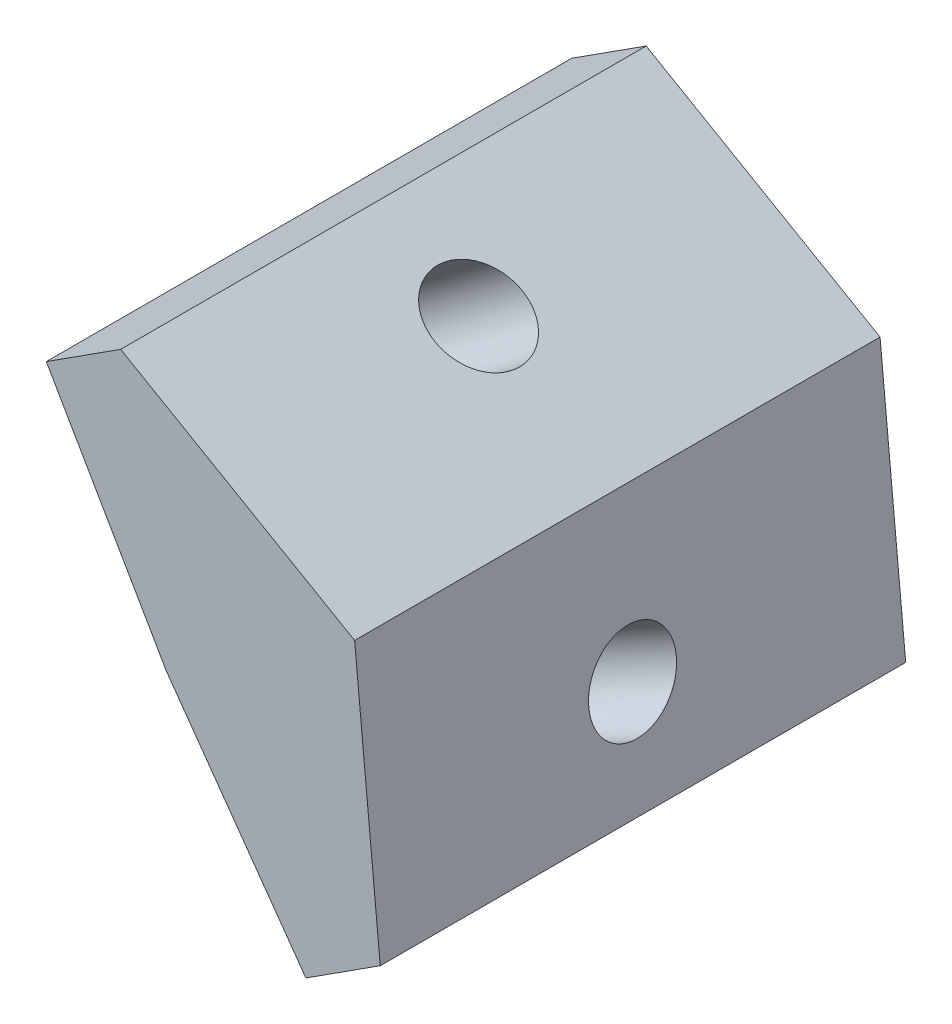
ISO-10303-21;
HEADER;
FILE_DESCRIPTION(('STEP AP214'),'2;1');
FILE_NAME('part.step','',(''),(''),'','','');
FILE_SCHEMA(('AUTOMOTIVE_DESIGN { 1 0 10303 214 1 1 1 1 }'));
ENDSEC;
DATA;
#1=APPLICATION_CONTEXT('core data for automotive mechanical design processes');
#2=APPLICATION_PROTOCOL_DEFINITION('international standard','automotive_design',2000,#1);
#3=PRODUCT_CONTEXT('',#1,'mechanical');
#4=PRODUCT('Part','Part','',(#3));
#5=PRODUCT_RELATED_PRODUCT_CATEGORY('part','',(#4));
#6=PRODUCT_DEFINITION_FORMATION('','',#4);
#7=PRODUCT_DEFINITION_CONTEXT('part definition',#1,'design');
#8=PRODUCT_DEFINITION('design','',#6,#7);
#9=PRODUCT_DEFINITION_SHAPE('','',#8);
#10=(LENGTH_UNIT() NAMED_UNIT(*) SI_UNIT(.MILLI.,.METRE.));
#11=(NAMED_UNIT(*) PLANE_ANGLE_UNIT() SI_UNIT($,.RADIAN.));
#12=(NAMED_UNIT(*) SI_UNIT($,.STERADIAN.) SOLID_ANGLE_UNIT());
#13=UNCERTAINTY_MEASURE_WITH_UNIT(LENGTH_MEASURE(1.E-05),#10,'distance_accuracy_value','');
#14=(GEOMETRIC_REPRESENTATION_CONTEXT(3) GLOBAL_UNCERTAINTY_ASSIGNED_CONTEXT((#13)) GLOBAL_UNIT_ASSIGNED_CONTEXT((#10,
#11,#12)) REPRESENTATION_CONTEXT('',''));
#15=CARTESIAN_POINT('',(0.,0.,0.));
#16=DIRECTION('',(0.,0.,1.));
#17=DIRECTION('',(1.,0.,0.));
#18=AXIS2_PLACEMENT_3D('',#15,#16,#17);
#19=CARTESIAN_POINT('',(2.14350896906507,-9.8273254068607,7.5));
#20=DIRECTION('',(0.866025403784439,0.5,0.));
#21=DIRECTION('',(-0.5,0.866025403784439,0.));
#22=AXIS2_PLACEMENT_3D('',#19,#20,#21);
#23=PLANE('',#22);
#24=DIRECTION('',(0.5,-0.866025403784439,0.));
#25=VECTOR('',#24,1.);
#26=CARTESIAN_POINT('',(2.14350896906507,-9.8273254068607,-7.5));
#27=LINE('',#26,#25);
#28=CARTESIAN_POINT('',(-1.28768671203867,-3.88432015647812,-7.5));
#29=VERTEX_POINT('',#28);
#30=CARTESIAN_POINT('',(2.14350896906507,-9.8273254068607,-7.5));
#31=VERTEX_POINT('',#30);
#32=EDGE_CURVE('E143',#29,#31,#27,.T.);
#33=ORIENTED_EDGE('',*,*,#32,.T.);
#34=DIRECTION('',(0.,0.,-1.));
#35=VECTOR('',#34,1.);
#36=CARTESIAN_POINT('',(2.14350896906507,-9.8273254068607,7.5));
#37=LINE('',#36,#35);
#38=CARTESIAN_POINT('',(2.14350896906507,-9.8273254068607,7.5));
#39=VERTEX_POINT('',#38);
#40=EDGE_CURVE('E140',#39,#31,#37,.T.);
#41=ORIENTED_EDGE('',*,*,#40,.F.);
#42=DIRECTION('',(0.5,-0.866025403784439,0.));
#43=VECTOR('',#42,1.);
#44=CARTESIAN_POINT('',(2.14350896906507,-9.8273254068607,7.5));
#45=LINE('',#44,#43);
#46=CARTESIAN_POINT('',(-1.28768671203867,-3.88432015647812,7.5));
#47=VERTEX_POINT('',#46);
#48=EDGE_CURVE('E85',#47,#39,#45,.T.);
#49=ORIENTED_EDGE('',*,*,#48,.F.);
#50=DIRECTION('',(0.,0.,-1.));
#51=VECTOR('',#50,1.);
#52=CARTESIAN_POINT('',(-1.28768671203867,-3.88432015647812,7.5));
#53=LINE('',#52,#51);
#54=EDGE_CURVE('E52',#47,#29,#53,.T.);
#55=ORIENTED_EDGE('',*,*,#54,.T.);
#56=EDGE_LOOP('',(#33,#41,#49,#55));
#57=FACE_BOUND('',#56,.T.);
#58=CARTESIAN_POINT('',(0.883104032008484,-7.64424001776803,0.));
#59=CARTESIAN_POINT('',(0.883102340796539,-7.64423708850301,0.0692360491478806));
#60=CARTESIAN_POINT('',(0.880217251156279,-7.6392399666617,0.138544782789748));
#61=CARTESIAN_POINT('',(0.868752455011231,-7.61938235724007,0.275212517791071));
#62=CARTESIAN_POINT('',(0.860172748501076,-7.60452186965044,0.342571519148689));
#63=CARTESIAN_POINT('',(0.837557341279015,-7.56535083530797,0.473531081509149));
#64=CARTESIAN_POINT('',(0.823521641926395,-7.54104029090948,0.53713164344835));
#65=CARTESIAN_POINT('',(0.790380846593859,-7.48363874959029,0.658806955690412));
#66=CARTESIAN_POINT('',(0.771275752709145,-7.45054775629858,0.7168817082771));
#67=CARTESIAN_POINT('',(0.728523260341341,-7.37649826736734,0.825907151696571));
#68=CARTESIAN_POINT('',(0.704875864028337,-7.3355397754865,0.876857845932855));
#69=CARTESIAN_POINT('',(0.653690960560685,-7.24688492210003,0.970228943636717));
#70=CARTESIAN_POINT('',(0.626153455311613,-7.19918856389494,1.01264935128285));
#71=CARTESIAN_POINT('',(0.567947868615407,-7.09837353045275,1.0877901267426));
#72=CARTESIAN_POINT('',(0.537279788571654,-7.04525485764636,1.12051049890455));
#73=CARTESIAN_POINT('',(0.47365891688207,-6.93506027545818,1.17534867469813));
#74=CARTESIAN_POINT('',(0.440706126053246,-6.87798436749149,1.19746648212118));
#75=CARTESIAN_POINT('',(0.373424713651803,-6.76144954280719,1.23048951778944));
#76=CARTESIAN_POINT('',(0.339096092392505,-6.70199062663229,1.24139474858811));
#77=CARTESIAN_POINT('',(0.27000984431079,-6.58232973485045,1.25169185177927));
#78=CARTESIAN_POINT('',(0.235252217519653,-6.5221277592977,1.25108372501126));
#79=CARTESIAN_POINT('',(0.166266618585461,-6.40264119695311,1.23837088949851));
#80=CARTESIAN_POINT('',(0.132038646442173,-6.34335661016087,1.22626618075885));
#81=CARTESIAN_POINT('',(0.0650564104898266,-6.22733997428683,1.19089404721105));
#82=CARTESIAN_POINT('',(0.03230214667851,-6.17060792520112,1.16762662242002));
#83=CARTESIAN_POINT('',(-0.0308292666829017,-6.06126110970552,1.11057080716508));
#84=CARTESIAN_POINT('',(-0.0612064162388335,-6.00864634328553,1.07678241672701));
#85=CARTESIAN_POINT('',(-0.11874576040662,-5.90898527575274,0.999616602972544));
#86=CARTESIAN_POINT('',(-0.145907955028472,-5.86193897462262,0.956239179685969));
#87=CARTESIAN_POINT('',(-0.196268222635298,-5.77471243244483,0.861091710242495));
#88=CARTESIAN_POINT('',(-0.21946629563384,-5.73453219137366,0.809321664114325));
#89=CARTESIAN_POINT('',(-0.261258489953188,-5.66214598745276,0.69881683635393));
#90=CARTESIAN_POINT('',(-0.27985261128947,-5.62994002457622,0.640082054745118));
#91=CARTESIAN_POINT('',(-0.311924055638079,-5.5743906534923,0.51726773696082));
#92=CARTESIAN_POINT('',(-0.325401378665407,-5.55104724525895,0.453188200801003));
#93=CARTESIAN_POINT('',(-0.346867507393485,-5.51386681966011,0.32145176709954));
#94=CARTESIAN_POINT('',(-0.354856313106203,-5.5000298022739,0.253794869565694));
#95=CARTESIAN_POINT('',(-0.365125067658483,-5.48224379765889,0.116769772117528));
#96=CARTESIAN_POINT('',(-0.367405016504841,-5.47829481041833,0.0474015722052451));
#97=CARTESIAN_POINT('',(-0.366193174015858,-5.48039378318001,-0.0911328723644529));
#98=CARTESIAN_POINT('',(-0.362701382680923,-5.48644174318156,-0.160299117021883));
#99=CARTESIAN_POINT('',(-0.350042367017631,-5.5083678014842,-0.29652196348423));
#100=CARTESIAN_POINT('',(-0.34087514268327,-5.52424589979569,-0.363578565286915));
#101=CARTESIAN_POINT('',(-0.317118102643942,-5.56539430018125,-0.493732623558334));
#102=CARTESIAN_POINT('',(-0.302528286927751,-5.59066460227476,-0.556830080018871));
#103=CARTESIAN_POINT('',(-0.268328467004248,-5.64990042799197,-0.677325540871189));
#104=CARTESIAN_POINT('',(-0.248718462782602,-5.68386595164051,-0.734723545246694));
#105=CARTESIAN_POINT('',(-0.205019131894172,-5.75955541299604,-0.842236990429847));
#106=CARTESIAN_POINT('',(-0.18092980521248,-5.80127935072885,-0.892352431213258));
#107=CARTESIAN_POINT('',(-0.128936241544613,-5.89133484466816,-0.983918497506408));
#108=CARTESIAN_POINT('',(-0.10103200454533,-5.93966640089736,-1.02536912298638));
#109=CARTESIAN_POINT('',(-0.0421782536827786,-6.04160408760731,-1.09846229197649));
#110=CARTESIAN_POINT('',(-0.0112287398098648,-6.09521021810476,-1.13010483545557));
#111=CARTESIAN_POINT('',(0.052861937281228,-6.20621852711802,-1.18270909288413));
#112=CARTESIAN_POINT('',(0.0860031005049996,-6.26362070564352,-1.20367080680635));
#113=CARTESIAN_POINT('',(0.153562998960528,-6.38063788232269,-1.23433524955404));
#114=CARTESIAN_POINT('',(0.187981734194402,-6.44025288048003,-1.24403797836085));
#115=CARTESIAN_POINT('',(0.257147461311182,-6.56005143398873,-1.2519168349498));
#116=CARTESIAN_POINT('',(0.29189445319428,-6.62023498934042,-1.25009296272525));
#117=CARTESIAN_POINT('',(0.360758324433378,-6.73951071313242,-1.234968921888));
#118=CARTESIAN_POINT('',(0.394875203789732,-6.79860288157334,-1.22166875328174));
#119=CARTESIAN_POINT('',(0.461537859932307,-6.91406598897979,-1.18395896049844));
#120=CARTESIAN_POINT('',(0.494083636721105,-6.97043692794979,-1.15954933633961));
#121=CARTESIAN_POINT('',(0.5567064341663,-7.07890279483694,-1.10029387881346));
#122=CARTESIAN_POINT('',(0.586783454828964,-7.13099772276495,-1.06544804547263));
#123=CARTESIAN_POINT('',(0.643639170382284,-7.22947471080399,-0.986281295689709));
#124=CARTESIAN_POINT('',(0.67041786528336,-7.27585677093305,-0.94196037927755));
#125=CARTESIAN_POINT('',(0.719938366477431,-7.36162879501747,-0.845065792742839));
#126=CARTESIAN_POINT('',(0.742680172784291,-7.40101875899684,-0.79249212264863));
#127=CARTESIAN_POINT('',(0.783499553075744,-7.47171999959511,-0.680542466029472));
#128=CARTESIAN_POINT('',(0.801577127075884,-7.50303127624095,-0.621166479527196));
#129=CARTESIAN_POINT('',(0.832569809563073,-7.5567121769716,-0.497248418404057));
#130=CARTESIAN_POINT('',(0.84548491806492,-7.57908180108204,-0.432706343798002));
#131=CARTESIAN_POINT('',(0.86462785427358,-7.6122383392015,-0.30785443337037));
#132=CARTESIAN_POINT('',(0.871453697505605,-7.62406104648389,-0.247910832774439));
#133=CARTESIAN_POINT('',(0.878388251890378,-7.63607204700617,-0.156424994979718));
#134=CARTESIAN_POINT('',(0.880149468628357,-7.63912256387948,-0.125354151458972));
#135=CARTESIAN_POINT('',(0.882511067080097,-7.64321297238496,-0.0628611958611329));
#136=CARTESIAN_POINT('',(0.883104799939,-7.6442413478627,-0.0314380909965054));
#137=CARTESIAN_POINT('',(0.883104032008484,-7.64424001776803,0.));
#138=B_SPLINE_CURVE_WITH_KNOTS('',3,(#58,#59,#60,#61,#62,#63,#64,#65,#66,#67,#68,#69,#70,#71,
#72,#73,#74,#75,#76,#77,#78,#79,#80,#81,#82,#83,#84,#85,#86,#87,#88,#89,#90,#91,#92,#93,#94,#95,
#96,#97,#98,#99,#100,#101,#102,#103,#104,#105,#106,#107,#108,#109,#110,#111,#112,#113,#114,#115,
#116,#117,#118,#119,#120,#121,#122,#123,#124,#125,#126,#127,#128,#129,#130,#131,#132,#133,#134,
#135,#136,#137),.UNSPECIFIED.,.T.,.F.,(4,2,2,2,2,2,2,2,2,2,2,2,2,2,2,2,2,2,2,2,2,2,2,2,2,2,2,2,
2,2,2,2,2,2,2,2,2,2,2,4),(0.,0.207595609090906,0.41519121837749,0.622786775944459,
0.830382247711449,1.03797762029992,1.24557289119783,1.45316806903482,1.66076317263668,
1.86835822896272,2.07595327015198,2.28354831124968,2.49114335202932,2.69873839229924,
2.90633343192363,3.11392847083743,3.32152350905341,3.5291185466608,3.73671358381552,
3.94430862072308,4.15190365761606,4.35949869472866,4.567093732271,4.77468877040612,
4.98228380923212,5.18987884877138,5.39747388896817,5.60506892969469,5.8126639707651,
6.02025901195591,6.2278540530304,6.43544909376461,6.64304413397189,6.85063917352327,
7.05823421236168,7.26582925050817,7.47342428805958,7.65715815108701,7.75088905193434,
7.84515222450689),.UNSPECIFIED.);
#139=CARTESIAN_POINT('',(0.883104032008484,-7.64424001776803,0.));
#140=VERTEX_POINT('',#139);
#141=EDGE_CURVE('E158',#140,#140,#138,.T.);
#142=ORIENTED_EDGE('',*,*,#141,.F.);
#143=EDGE_LOOP('',(#142));
#144=FACE_BOUND('',#143,.T.);
#145=ADVANCED_FACE('F38',(#57,#144),#23,.F.);
#146=CARTESIAN_POINT('',(0.835256512918846,-2.52045522789622,7.5));
#147=DIRECTION('',(-0.5,-0.866025403784438,0.));
#148=DIRECTION('',(0.866025403784439,-0.5,0.));
#149=AXIS2_PLACEMENT_3D('',#146,#147,#148);
#150=PLANE('',#149);
#151=DIRECTION('',(-0.866025403784439,0.5,0.));
#152=VECTOR('',#151,1.);
#153=CARTESIAN_POINT('',(0.835256512918846,-2.52045522789622,-7.5));
#154=LINE('',#153,#152);
#155=CARTESIAN_POINT('',(7.51412157971769,-6.37649977209372,-7.5));
#156=VERTEX_POINT('',#155);
#157=CARTESIAN_POINT('',(0.835256512918846,-2.52045522789622,-7.5));
#158=VERTEX_POINT('',#157);
#159=EDGE_CURVE('E75',#156,#158,#154,.T.);
#160=ORIENTED_EDGE('',*,*,#159,.T.);
#161=DIRECTION('',(0.,0.,-1.));
#162=VECTOR('',#161,1.);
#163=CARTESIAN_POINT('',(0.835256512918846,-2.52045522789622,7.5));
#164=LINE('',#163,#162);
#165=CARTESIAN_POINT('',(0.835256512918846,-2.52045522789622,7.5));
#166=VERTEX_POINT('',#165);
#167=EDGE_CURVE('E11',#166,#158,#164,.T.);
#168=ORIENTED_EDGE('',*,*,#167,.F.);
#169=DIRECTION('',(-0.866025403784439,0.5,0.));
#170=VECTOR('',#169,1.);
#171=CARTESIAN_POINT('',(0.835256512918846,-2.52045522789622,7.5));
#172=LINE('',#171,#170);
#173=CARTESIAN_POINT('',(7.51412157971769,-6.37649977209372,7.5));
#174=VERTEX_POINT('',#173);
#175=EDGE_CURVE('E145',#174,#166,#172,.T.);
#176=ORIENTED_EDGE('',*,*,#175,.F.);
#177=DIRECTION('',(0.,0.,-1.));
#178=VECTOR('',#177,1.);
#179=CARTESIAN_POINT('',(7.51412157971769,-6.37649977209372,7.5));
#180=LINE('',#179,#178);
#181=EDGE_CURVE('E123',#174,#156,#180,.T.);
#182=ORIENTED_EDGE('',*,*,#181,.T.);
#183=EDGE_LOOP('',(#160,#168,#176,#182));
#184=FACE_BOUND('',#183,.T.);
#185=CARTESIAN_POINT('',(4.72106738931913,-4.76392918340589,0.));
#186=CARTESIAN_POINT('',(4.72106967318457,-4.76393050199623,-0.0326200650917741));
#187=CARTESIAN_POINT('',(4.71987624319128,-4.76324147486835,-0.0652249095850014));
#188=CARTESIAN_POINT('',(4.71276913198931,-4.7591381823027,-0.162058237227164));
#189=CARTESIAN_POINT('',(4.70337838596133,-4.75371643255546,-0.225999536111689));
#190=CARTESIAN_POINT('',(4.67543224365237,-4.73758171977082,-0.352026528897048));
#191=CARTESIAN_POINT('',(4.65675391484363,-4.72679778160543,-0.414075147802528));
#192=CARTESIAN_POINT('',(4.61087026576137,-4.70030684445542,-0.533846243075587));
#193=CARTESIAN_POINT('',(4.58366425695649,-4.68459944794705,-0.591568369652415));
#194=CARTESIAN_POINT('',(4.53696734079734,-4.65763897083301,-0.674260574796789));
#195=CARTESIAN_POINT('',(4.52025824280692,-4.64799196861106,-0.701382247882845));
#196=CARTESIAN_POINT('',(4.48503666797841,-4.62765678290308,-0.754004700539092));
#197=CARTESIAN_POINT('',(4.46652472715263,-4.61696890888391,-0.779505958179659));
#198=CARTESIAN_POINT('',(4.40805232449428,-4.58320985146866,-0.853942448460409));
#199=CARTESIAN_POINT('',(4.36549754352667,-4.55864083722186,-0.900207929121429));
#200=CARTESIAN_POINT('',(4.27478486199642,-4.50626784612156,-0.984756800207651));
#201=CARTESIAN_POINT('',(4.22662299199164,-4.47846157750956,-1.0230344816162));
#202=CARTESIAN_POINT('',(4.14889486066869,-4.43358521996664,-1.07552705889411));
#203=CARTESIAN_POINT('',(4.12082963659478,-4.41738175529271,-1.09276978462856));
#204=CARTESIAN_POINT('',(4.06363603632761,-4.38436101478255,-1.12462731830785));
#205=CARTESIAN_POINT('',(4.03450867506674,-4.36754432491781,-1.13924455978835));
#206=CARTESIAN_POINT('',(3.94577295372633,-4.31631273231518,-1.17909650466869));
#207=CARTESIAN_POINT('',(3.88478415098041,-4.28110083063226,-1.20034940083555));
#208=CARTESIAN_POINT('',(3.76075974227071,-4.20949530487763,-1.23188886326121));
#209=CARTESIAN_POINT('',(3.69772434886931,-4.17310180352885,-1.24217656465293));
#210=CARTESIAN_POINT('',(3.5710278972785,-4.09995357309754,-1.25168768497733));
#211=CARTESIAN_POINT('',(3.50736686341834,-4.06319885806149,-1.25091153246147));
#212=CARTESIAN_POINT('',(3.38086887013213,-3.99016520758575,-1.23829967470822));
#213=CARTESIAN_POINT('',(3.31803193235611,-3.9538862846457,-1.22646367950285));
#214=CARTESIAN_POINT('',(3.19463885199562,-3.88264525648344,-1.191870988607));
#215=CARTESIAN_POINT('',(3.13408291768695,-3.8476832715093,-1.16911329826351));
#216=CARTESIAN_POINT('',(3.01675916579137,-3.77994637177007,-1.11297172554038));
#217=CARTESIAN_POINT('',(2.95999193694101,-3.74717179691216,-1.07958619630299));
#218=CARTESIAN_POINT('',(2.85181189982572,-3.68471402336273,-1.0026963405394));
#219=CARTESIAN_POINT('',(2.80040024561944,-3.65503149096727,-0.959189839575163));
#220=CARTESIAN_POINT('',(2.7058353001336,-3.60043439423514,-0.864151895551862));
#221=CARTESIAN_POINT('',(2.66249898317709,-3.57541415997462,-0.812864194408299));
#222=CARTESIAN_POINT('',(2.5853354010071,-3.53086374503713,-0.704564659765068));
#223=CARTESIAN_POINT('',(2.55122250971071,-3.51116865806432,-0.647824574789513));
#224=CARTESIAN_POINT('',(2.49265150775312,-3.4773526743174,-0.530310352112419));
#225=CARTESIAN_POINT('',(2.46792889226326,-3.46307906560925,-0.469713789593113));
#226=CARTESIAN_POINT('',(2.43795173466125,-3.44577174559815,-0.376661216173694));
#227=CARTESIAN_POINT('',(2.42920596705618,-3.44072237431707,-0.345656373396277));
#228=CARTESIAN_POINT('',(2.41396284042429,-3.43192175105285,-0.282885357863));
#229=CARTESIAN_POINT('',(2.40746766336352,-3.42817175882839,-0.251118478024343));
#230=CARTESIAN_POINT('',(2.3914730690128,-3.41893727547444,-0.154978956552912));
#231=CARTESIAN_POINT('',(2.38547002249219,-3.41547141494979,-0.0897842658630903));
#232=CARTESIAN_POINT('',(2.38307949246202,-3.41409124179335,0.0408269050711149));
#233=CARTESIAN_POINT('',(2.38668985214948,-3.41617568393079,0.106243332279397));
#234=CARTESIAN_POINT('',(2.3991097489928,-3.42334631471658,0.202605784035211));
#235=CARTESIAN_POINT('',(2.40435485816512,-3.42637457990914,0.234211616626148));
#236=CARTESIAN_POINT('',(2.41707595519607,-3.43371910870436,0.296814443716138));
#237=CARTESIAN_POINT('',(2.42455163100436,-3.43803519214466,0.327811522732132));
#238=CARTESIAN_POINT('',(2.45045289426842,-3.45298929346246,0.420372585398311));
#239=CARTESIAN_POINT('',(2.47225052031973,-3.4655741587307,0.480720274929827));
#240=CARTESIAN_POINT('',(2.5239699366247,-3.49543437765715,0.596586917269807));
#241=CARTESIAN_POINT('',(2.55389530055352,-3.51271179457766,0.652103731785444));
#242=CARTESIAN_POINT('',(2.60460574534586,-3.54198948352889,0.731608335062336));
#243=CARTESIAN_POINT('',(2.62280169791135,-3.55249492164039,0.757847855540888));
#244=CARTESIAN_POINT('',(2.66092595815545,-3.57450597355472,0.808575764876726));
#245=CARTESIAN_POINT('',(2.68085369083958,-3.58601125538432,0.83306473007761));
#246=CARTESIAN_POINT('',(2.74348591600754,-3.62217198744512,0.904260437703067));
#247=CARTESIAN_POINT('',(2.78866606416938,-3.64825675814832,0.948114031320764));
#248=CARTESIAN_POINT('',(2.88426931560054,-3.70345332109747,1.02743225109201));
#249=CARTESIAN_POINT('',(2.93469612411556,-3.73256725256804,1.06289088995916));
#250=CARTESIAN_POINT('',(3.01570003147155,-3.77933488028542,1.11081365172615));
#251=CARTESIAN_POINT('',(3.04491598808175,-3.79620272069893,1.12641608172058));
#252=CARTESIAN_POINT('',(3.10429643131536,-3.83048603558444,1.15488831870823));
#253=CARTESIAN_POINT('',(3.13446001369664,-3.84790098799201,1.16776064502737));
#254=CARTESIAN_POINT('',(3.2261283338364,-3.90082571730087,1.20223005659629));
#255=CARTESIAN_POINT('',(3.28883800176378,-3.93703116095953,1.2196956422563));
#256=CARTESIAN_POINT('',(3.41579342599116,-4.01032890931229,1.24332268311916));
#257=CARTESIAN_POINT('',(3.4800390550581,-4.04742114054833,1.24948507137083));
#258=CARTESIAN_POINT('',(3.60860091207748,-4.12164636330599,1.25045278365266));
#259=CARTESIAN_POINT('',(3.672917139008,-4.15877935423759,1.24525826996499));
#260=CARTESIAN_POINT('',(3.80011151473358,-4.23221506130217,1.22356811808028));
#261=CARTESIAN_POINT('',(3.86298958566123,-4.26851773247837,1.20707186945277));
#262=CARTESIAN_POINT('',(3.98577808413719,-4.33940970512685,1.16298324080194));
#263=CARTESIAN_POINT('',(4.0456881485756,-4.37399879695753,1.13538950684421));
#264=CARTESIAN_POINT('',(4.16095054307543,-4.44054557144944,1.06949451412498));
#265=CARTESIAN_POINT('',(4.21630201353285,-4.47250275781806,1.03119124184693));
#266=CARTESIAN_POINT('',(4.31985430663316,-4.5322887021147,0.94530426272939));
#267=CARTESIAN_POINT('',(4.36816434290843,-4.56018051456277,0.897896795495181));
#268=CARTESIAN_POINT('',(4.4555222645776,-4.6106166341543,0.796273816815416));
#269=CARTESIAN_POINT('',(4.49484850253334,-4.63332164822426,0.742378363149144));
#270=CARTESIAN_POINT('',(4.5638948740261,-4.67318558939218,0.629643835963395));
#271=CARTESIAN_POINT('',(4.59389564075583,-4.69050654013949,0.571034511867945));
#272=CARTESIAN_POINT('',(4.64424123262077,-4.71957358115525,0.450486484779562));
#273=CARTESIAN_POINT('',(4.66482962224433,-4.7314602934466,0.388684248227226));
#274=CARTESIAN_POINT('',(4.69396060389246,-4.74827907354293,0.273105169420572));
#275=CARTESIAN_POINT('',(4.70398112043004,-4.75406442146332,0.219817784595057));
#276=CARTESIAN_POINT('',(4.71759972066438,-4.76192712397461,0.111021016201028));
#277=CARTESIAN_POINT('',(4.72106350434105,-4.76392694041274,0.0554884870589953));
#278=CARTESIAN_POINT('',(4.72106738931913,-4.76392918340589,0.));
#279=B_SPLINE_CURVE_WITH_KNOTS('',3,(#185,#186,#187,#188,#189,#190,#191,#192,#193,#194,#195,
#196,#197,#198,#199,#200,#201,#202,#203,#204,#205,#206,#207,#208,#209,#210,#211,#212,#213,#214,
#215,#216,#217,#218,#219,#220,#221,#222,#223,#224,#225,#226,#227,#228,#229,#230,#231,#232,#233,
#234,#235,#236,#237,#238,#239,#240,#241,#242,#243,#244,#245,#246,#247,#248,#249,#250,#251,#252,
#253,#254,#255,#256,#257,#258,#259,#260,#261,#262,#263,#264,#265,#266,#267,#268,#269,#270,#271,
#272,#273,#274,#275,#276,#277,#278),.UNSPECIFIED.,.T.,.F.,(4,2,2,2,2,2,2,2,2,2,2,2,2,2,2,2,2,2,
2,2,2,2,2,2,2,2,2,2,2,2,2,2,2,2,2,2,2,2,2,2,2,2,2,2,2,2,4),(0.,0.0978185092397406,
0.291391946155557,0.487598637908893,0.683821175621743,0.783584199879795,0.883317653118187,
1.08492172291572,1.28666939278725,1.39669125755627,1.50661061188256,1.72634312704996,
1.94605289297756,2.16575414860783,2.38546116454733,2.605188193289,2.8249492868532,
3.04475763861944,3.25872982637459,3.46501695374031,3.6649641313305,3.76269124733411,
3.86051284720509,4.05620925768471,4.25186176665577,4.34830949577576,4.44474373843607,
4.63996767936108,4.83527759741393,4.93602965169123,5.03674838064017,5.24033425974747,
5.44406490194388,5.55546594892597,5.66676374394797,5.88925418708064,6.11172626339364,
6.33419516075704,6.55667607508072,6.77918414114032,7.00173406944262,7.22034536866381,
7.43079908129201,7.63411294275235,7.83181753013738,7.99490626886137,8.16130081984753),.UNSPECIFIED.);
#280=CARTESIAN_POINT('',(4.72106738931913,-4.76392918340589,0.));
#281=VERTEX_POINT('',#280);
#282=EDGE_CURVE('E42',#281,#281,#279,.T.);
#283=ORIENTED_EDGE('',*,*,#282,.F.);
#284=EDGE_LOOP('',(#283));
#285=FACE_BOUND('',#284,.T.);
#286=ADVANCED_FACE('F184',(#184,#285),#150,.F.);
#287=CARTESIAN_POINT('',(2.14350896906507,-9.8273254068607,7.5));
#288=DIRECTION('',(0.814676461440646,0.579915737995227,0.));
#289=DIRECTION('',(0.579915737995227,-0.814676461440645,0.));
#290=AXIS2_PLACEMENT_3D('',#287,#288,#289);
#291=PLANE('',#290);
#292=DIRECTION('',(-0.579915737995227,0.814676461440645,0.));
#293=VECTOR('',#292,1.);
#294=CARTESIAN_POINT('',(2.14350896906507,-9.8273254068607,-7.5));
#295=LINE('',#294,#293);
#296=CARTESIAN_POINT('',(6.12311772029169,-15.4179541188447,-7.5));
#297=VERTEX_POINT('',#296);
#298=EDGE_CURVE('E131',#297,#31,#295,.T.);
#299=ORIENTED_EDGE('',*,*,#298,.F.);
#300=DIRECTION('',(0.,0.,-1.));
#301=VECTOR('',#300,1.);
#302=CARTESIAN_POINT('',(6.12311772029169,-15.4179541188447,7.5));
#303=LINE('',#302,#301);
#304=CARTESIAN_POINT('',(6.12311772029169,-15.4179541188447,7.5));
#305=VERTEX_POINT('',#304);
#306=EDGE_CURVE('E114',#305,#297,#303,.T.);
#307=ORIENTED_EDGE('',*,*,#306,.F.);
#308=DIRECTION('',(-0.579915737995227,0.814676461440645,0.));
#309=VECTOR('',#308,1.);
#310=CARTESIAN_POINT('',(2.14350896906507,-9.8273254068607,7.5));
#311=LINE('',#310,#309);
#312=EDGE_CURVE('E110',#305,#39,#311,.T.);
#313=ORIENTED_EDGE('',*,*,#312,.T.);
#314=ORIENTED_EDGE('',*,*,#40,.T.);
#315=EDGE_LOOP('',(#299,#307,#313,#314));
#316=FACE_BOUND('',#315,.T.);
#317=CARTESIAN_POINT('',(5.05551304171518,-13.9181631237479,0.));
#318=CARTESIAN_POINT('',(5.05551108020523,-13.9181603681821,0.0692358626819055));
#319=CARTESIAN_POINT('',(5.05216486839555,-13.9134595473253,0.138544405837948));
#320=CARTESIAN_POINT('',(5.03886766385389,-13.8947793859961,0.275211754098841));
#321=CARTESIAN_POINT('',(5.02891667208249,-13.8808000468732,0.342570559487259));
#322=CARTESIAN_POINT('',(5.00268667255748,-13.8439516535696,0.473529755417838));
#323=CARTESIAN_POINT('',(4.98640766483664,-13.8210825994349,0.537130145979466));
#324=CARTESIAN_POINT('',(4.94797002026671,-13.7670846783359,0.658805162167838));
#325=CARTESIAN_POINT('',(4.92581138346064,-13.735955811432,0.716879787835013));
#326=CARTESIAN_POINT('',(4.87622581566166,-13.6662970795399,0.825905040356847));
#327=CARTESIAN_POINT('',(4.84879888471432,-13.6277672146158,0.876855667273146));
#328=CARTESIAN_POINT('',(4.78943315826703,-13.5443691331632,0.970226708469664));
#329=CARTESIAN_POINT('',(4.75749436280785,-13.4995009166921,1.01264712282699));
#330=CARTESIAN_POINT('',(4.68998583197287,-13.4046636715299,1.08778800206828));
#331=CARTESIAN_POINT('',(4.6544160966277,-13.3546946428818,1.12050846703406));
#332=CARTESIAN_POINT('',(4.58062673679968,-13.2510339718255,1.17534692644398));
#333=CARTESIAN_POINT('',(4.54240711233514,-13.1973423294431,1.19746492096136));
#334=CARTESIAN_POINT('',(4.46437211192286,-13.0877173031864,1.23048843042265));
#335=CARTESIAN_POINT('',(4.4245567359825,-13.0317839193225,1.24139394541841));
#336=CARTESIAN_POINT('',(4.34442837893356,-12.9192181065592,1.25169171124793));
#337=CARTESIAN_POINT('',(4.30411539782588,-12.862585677661,1.2510839621028));
#338=CARTESIAN_POINT('',(4.22410370058144,-12.7501837507702,1.23837196303157));
#339=CARTESIAN_POINT('',(4.18440498444538,-12.6944142527786,1.22626771309217));
#340=CARTESIAN_POINT('',(4.10671674626118,-12.5852763645773,1.19089655368162));
#341=CARTESIAN_POINT('',(4.06872722421992,-12.5319079743774,1.16762964416557));
#342=CARTESIAN_POINT('',(3.99550516489911,-12.4290442576708,1.11057488097866));
#343=CARTESIAN_POINT('',(3.96027262763734,-12.379548931189,1.07678702723996));
#344=CARTESIAN_POINT('',(3.89353629193725,-12.2857964801767,0.999622268521541));
#345=CARTESIAN_POINT('',(3.86203249352938,-12.2415393556889,0.956245363463517));
#346=CARTESIAN_POINT('',(3.80362255099345,-12.1594839773289,0.861098873798051));
#347=CARTESIAN_POINT('',(3.7767164069067,-12.1216857235147,0.809329289115168));
#348=CARTESIAN_POINT('',(3.72824388320742,-12.0535906167653,0.698825296714438));
#349=CARTESIAN_POINT('',(3.70667750364202,-12.0232937638964,0.640090888935111));
#350=CARTESIAN_POINT('',(3.66947934386804,-11.971037094192,0.517277211959677));
#351=CARTESIAN_POINT('',(3.65384756370516,-11.9490772774208,0.453197942722421));
#352=CARTESIAN_POINT('',(3.62894975466452,-11.9141003701947,0.32146193366529));
#353=CARTESIAN_POINT('',(3.61968372542715,-11.9010832792345,0.253805194047521));
#354=CARTESIAN_POINT('',(3.60777299261419,-11.8843508592889,0.116780330417305));
#355=CARTESIAN_POINT('',(3.60512828653079,-11.8806355267803,0.0474122070530549));
#356=CARTESIAN_POINT('',(3.60653313848127,-11.8826090890427,-0.0911221816600884));
#357=CARTESIAN_POINT('',(3.61058269651639,-11.8882979838153,-0.160288447008944));
#358=CARTESIAN_POINT('',(3.62526438261808,-11.9089230907018,-0.296511420127774));
#359=CARTESIAN_POINT('',(3.63589651066637,-11.92385930279,-0.363568127903608));
#360=CARTESIAN_POINT('',(3.66345008409521,-11.9625670774378,-0.493722474367902));
#361=CARTESIAN_POINT('',(3.68037152944158,-11.9863386399495,-0.556820113077882));
#362=CARTESIAN_POINT('',(3.72003701598272,-12.0420614563855,-0.677316012191581));
#363=CARTESIAN_POINT('',(3.74278105713383,-12.0740127102485,-0.734714272638035));
#364=CARTESIAN_POINT('',(3.79346441984098,-12.1452136449342,-0.842228309052006));
#365=CARTESIAN_POINT('',(3.82140374135162,-12.184463325693,-0.892344085083167));
#366=CARTESIAN_POINT('',(3.8817070595944,-12.2691785536138,-0.983910912570473));
#367=CARTESIAN_POINT('',(3.91407105628662,-12.3146441007198,-1.0253619641048));
#368=CARTESIAN_POINT('',(3.98233108578898,-12.4105370652478,-1.09845608982841));
#369=CARTESIAN_POINT('',(4.01822711856973,-12.4609644826286,-1.13009916409928));
#370=CARTESIAN_POINT('',(4.09256116797759,-12.5653903437813,-1.18270459852466));
#371=CARTESIAN_POINT('',(4.13099918458765,-12.6193887875292,-1.20366695875075));
#372=CARTESIAN_POINT('',(4.20935704267664,-12.7294673702811,-1.23433281158421));
#373=CARTESIAN_POINT('',(4.24927688414913,-12.7855475092759,-1.24403630424056));
#374=CARTESIAN_POINT('',(4.32949736527979,-12.8982427396701,-1.2519167950458));
#375=CARTESIAN_POINT('',(4.36979800493739,-12.9548578310687,-1.25009379321225));
#376=CARTESIAN_POINT('',(4.44966855387264,-13.0670614701781,-1.23497157381143));
#377=CARTESIAN_POINT('',(4.48923846314922,-13.1226500178875,-1.22167235622728));
#378=CARTESIAN_POINT('',(4.56655617496885,-13.2312673837304,-1.1839645064842));
#379=CARTESIAN_POINT('',(4.60430397750404,-13.2842962018529,-1.15955587427745));
#380=CARTESIAN_POINT('',(4.67693635478154,-13.38633152221,-1.10030239222835));
#381=CARTESIAN_POINT('',(4.71182092950476,-13.4353380244178,-1.06545754231644));
#382=CARTESIAN_POINT('',(4.77776468652152,-13.5279770460905,-0.986292697665733));
#383=CARTESIAN_POINT('',(4.80882386878331,-13.5716095655109,-0.941972702848322));
#384=CARTESIAN_POINT('',(4.86626021927981,-13.6522972235874,-0.845079848038752));
#385=CARTESIAN_POINT('',(4.89263738747228,-13.6893523621842,-0.792506987972163));
#386=CARTESIAN_POINT('',(4.93998207601279,-13.7558630650348,-0.680558797629209));
#387=CARTESIAN_POINT('',(4.96094959631348,-13.7853186292221,-0.621183467293302));
#388=CARTESIAN_POINT('',(4.99689709650881,-13.8358183489884,-0.497266542456649));
#389=CARTESIAN_POINT('',(5.01187707635839,-13.8568625045039,-0.432724947917011));
#390=CARTESIAN_POINT('',(5.03408141655667,-13.8880555763869,-0.30787065910085));
#391=CARTESIAN_POINT('',(5.04199910739307,-13.8991784963747,-0.247924083108685));
#392=CARTESIAN_POINT('',(5.05004291301623,-13.9104785847707,-0.156433524947279));
#393=CARTESIAN_POINT('',(5.0520858576182,-13.9133485515094,-0.125361012415933));
#394=CARTESIAN_POINT('',(5.05482522398544,-13.9171968645528,-0.0628646576544224));
#395=CARTESIAN_POINT('',(5.05551393243166,-13.918164375043,-0.0314398223443932));
#396=CARTESIAN_POINT('',(5.05551304171518,-13.9181631237479,0.));
#397=B_SPLINE_CURVE_WITH_KNOTS('',3,(#317,#318,#319,#320,#321,#322,#323,#324,#325,#326,#327,
#328,#329,#330,#331,#332,#333,#334,#335,#336,#337,#338,#339,#340,#341,#342,#343,#344,#345,#346,
#347,#348,#349,#350,#351,#352,#353,#354,#355,#356,#357,#358,#359,#360,#361,#362,#363,#364,#365,
#366,#367,#368,#369,#370,#371,#372,#373,#374,#375,#376,#377,#378,#379,#380,#381,#382,#383,#384,
#385,#386,#387,#388,#389,#390,#391,#392,#393,#394,#395,#396),.UNSPECIFIED.,.T.,.F.,(4,2,2,2,2,2,
2,2,2,2,2,2,2,2,2,2,2,2,2,2,2,2,2,2,2,2,2,2,2,2,2,2,2,2,2,2,2,2,2,4),(0.,0.207595043011116,
0.415190055829752,0.622785067573066,0.830380077797414,1.03797508622557,1.24557009277712,
1.45316509757725,1.66076010094304,1.86835510334871,2.07595010537368,2.28354510763908,
2.49114011073969,2.69873511517879,2.90633012131302,3.11392512931329,3.32152013914605,
3.52911515057699,3.73671015028009,3.94430507135665,4.15189999247151,4.35949491300968,
4.56708983241937,4.77468475027241,4.98227966631122,5.18987458047696,5.39746949291605,
5.60506440396404,5.81265931410893,6.02025422393764,6.22784913407175,6.43544404509935,
6.64303895751067,6.85063387164432,7.05822878765022,7.26582370547315,7.47341862485882,
7.65716205990829,7.75089805762189,7.84516641825208),.UNSPECIFIED.);
#398=CARTESIAN_POINT('',(5.05551304171518,-13.9181631237479,0.));
#399=VERTEX_POINT('',#398);
#400=EDGE_CURVE('E135',#399,#399,#397,.T.);
#401=ORIENTED_EDGE('',*,*,#400,.F.);
#402=EDGE_LOOP('',(#401));
#403=FACE_BOUND('',#402,.T.);
#404=ADVANCED_FACE('F180',(#316,#403),#291,.F.);
#405=CARTESIAN_POINT('',(8.24587181947655,-14.0537948487437,7.5));
#406=DIRECTION('',(-0.995488380470426,-0.0948835304379445,0.));
#407=DIRECTION('',(-0.0948835304379442,0.995488380470426,0.));
#408=AXIS2_PLACEMENT_3D('',#405,#406,#407);
#409=PLANE('',#408);
#410=DIRECTION('',(0.0948835304379442,-0.995488380470426,0.));
#411=VECTOR('',#410,1.);
#412=CARTESIAN_POINT('',(8.24587181947655,-14.0537948487437,-7.5));
#413=LINE('',#412,#411);
#414=CARTESIAN_POINT('',(8.24587181947655,-14.0537948487437,-7.5));
#415=VERTEX_POINT('',#414);
#416=EDGE_CURVE('E134',#156,#415,#413,.T.);
#417=ORIENTED_EDGE('',*,*,#416,.F.);
#418=ORIENTED_EDGE('',*,*,#181,.F.);
#419=DIRECTION('',(0.0948835304379442,-0.995488380470426,0.));
#420=VECTOR('',#419,1.);
#421=CARTESIAN_POINT('',(8.24587181947655,-14.0537948487437,7.5));
#422=LINE('',#421,#420);
#423=CARTESIAN_POINT('',(8.24587181947655,-14.0537948487437,7.5));
#424=VERTEX_POINT('',#423);
#425=EDGE_CURVE('E107',#174,#424,#422,.T.);
#426=ORIENTED_EDGE('',*,*,#425,.T.);
#427=DIRECTION('',(0.,0.,-1.));
#428=VECTOR('',#427,1.);
#429=CARTESIAN_POINT('',(8.24587181947655,-14.0537948487437,7.5));
#430=LINE('',#429,#428);
#431=EDGE_CURVE('E117',#424,#415,#430,.T.);
#432=ORIENTED_EDGE('',*,*,#431,.T.);
#433=EDGE_LOOP('',(#417,#418,#426,#432));
#434=FACE_BOUND('',#433,.T.);
#435=CARTESIAN_POINT('',(8.07625127751527,-12.2741890748841,0.));
#436=CARTESIAN_POINT('',(8.07625151843158,-12.2741916025028,-0.0326198839279748));
#437=CARTESIAN_POINT('',(8.07612076954571,-12.2728198260096,-0.06522502540298));
#438=CARTESIAN_POINT('',(8.0753421073007,-12.2646503448192,-0.162059018871284));
#439=CARTESIAN_POINT('',(8.07431322973643,-12.2538556826122,-0.226000428305317));
#440=CARTESIAN_POINT('',(8.07125135231442,-12.2217314205598,-0.352028874737889));
#441=CARTESIAN_POINT('',(8.06920486700829,-12.2002603355995,-0.414078793166524));
#442=CARTESIAN_POINT('',(8.06417770879428,-12.1475169610128,-0.533850256360196));
#443=CARTESIAN_POINT('',(8.06119699129428,-12.1162442035396,-0.591571594353375));
#444=CARTESIAN_POINT('',(8.05608081947994,-12.0625669260308,-0.674263087564605));
#445=CARTESIAN_POINT('',(8.0542501351734,-12.0433599577857,-0.701384754784569));
#446=CARTESIAN_POINT('',(8.05039117521724,-12.0028729546166,-0.754007322168896));
#447=CARTESIAN_POINT('',(8.04836295732328,-11.9815935256469,-0.779508692500267));
#448=CARTESIAN_POINT('',(8.04195657113827,-11.9143797217517,-0.853945396736079));
#449=CARTESIAN_POINT('',(8.03729416249345,-11.8654631857669,-0.90021096194561));
#450=CARTESIAN_POINT('',(8.02735545540424,-11.7611893736666,-0.984759889863757));
#451=CARTESIAN_POINT('',(8.02207872252479,-11.7058275395943,-1.02303754964561));
#452=CARTESIAN_POINT('',(8.01356265165593,-11.6164795825983,-1.07552993400084));
#453=CARTESIAN_POINT('',(8.01048777184075,-11.5842189034981,-1.09277253239832));
#454=CARTESIAN_POINT('',(8.00422153172908,-11.5184754684506,-1.12462980778542));
#455=CARTESIAN_POINT('',(8.00103028263125,-11.4849938791652,-1.13924691833986));
#456=CARTESIAN_POINT('',(7.99130822884469,-11.3829931258821,-1.17909846234138));
#457=CARTESIAN_POINT('',(7.9846261809035,-11.3128871648951,-1.20035107996944));
#458=CARTESIAN_POINT('',(7.97103783608325,-11.1703224930711,-1.23188995050343));
#459=CARTESIAN_POINT('',(7.96413156249125,-11.0978640265547,-1.24217733847835));
#460=CARTESIAN_POINT('',(7.95025047050343,-10.9522279428389,-1.25168779227539));
#461=CARTESIAN_POINT('',(7.94327565477277,-10.8790503536014,-1.2509112866116));
#462=CARTESIAN_POINT('',(7.92941631649012,-10.7336425029691,-1.23829868740153));
#463=CARTESIAN_POINT('',(7.9225317963104,-10.6614122664634,-1.22646230387456));
#464=CARTESIAN_POINT('',(7.90901265192288,-10.5195736239765,-1.19186881586602));
#465=CARTESIAN_POINT('',(7.90237805053449,-10.4499654574094,-1.16911071674634));
#466=CARTESIAN_POINT('',(7.88952388994699,-10.3151036173567,-1.11296833080061));
#467=CARTESIAN_POINT('',(7.88330439525043,-10.2498506206116,-1.07958239716686));
#468=CARTESIAN_POINT('',(7.87145205552224,-10.1254995722647,-1.00269177008623));
#469=CARTESIAN_POINT('',(7.86581933692842,-10.0664028472088,-0.959184902295512));
#470=CARTESIAN_POINT('',(7.85545871210932,-9.95770240600213,-0.864146341955469));
#471=CARTESIAN_POINT('',(7.85071075251823,-9.90788829619756,-0.812858395625821));
#472=CARTESIAN_POINT('',(7.84225665532701,-9.81919054768018,-0.70455836913613));
#473=CARTESIAN_POINT('',(7.83851922573904,-9.77997860319973,-0.647818017289664));
#474=CARTESIAN_POINT('',(7.83210215893197,-9.71265274154968,-0.530303246864706));
#475=CARTESIAN_POINT('',(7.82939354376741,-9.68423479682271,-0.469706389324142));
#476=CARTESIAN_POINT('',(7.82610925286633,-9.64977704198386,-0.376653390619741));
#477=CARTESIAN_POINT('',(7.82515107050251,-9.63972409174975,-0.345648382416086));
#478=CARTESIAN_POINT('',(7.82348104731153,-9.62220272978042,-0.282877055684652));
#479=CARTESIAN_POINT('',(7.82276944554604,-9.6147368262056,-0.251110030093865));
#480=CARTESIAN_POINT('',(7.82101711446961,-9.59635191559694,-0.154970025609043));
#481=CARTESIAN_POINT('',(7.82035945737506,-9.58945198266953,-0.0897750270547689));
#482=CARTESIAN_POINT('',(7.82009764778828,-9.5867051582173,0.0408366681583352));
#483=CARTESIAN_POINT('',(7.82049325900041,-9.59085578755252,0.106253311803704));
#484=CARTESIAN_POINT('',(7.82185408874075,-9.60513318836215,0.202616026761758));
#485=CARTESIAN_POINT('',(7.82242878060204,-9.61116267596267,0.234221941593119));
#486=CARTESIAN_POINT('',(7.82382258445422,-9.62578603085981,0.296824909958764));
#487=CARTESIAN_POINT('',(7.82464166225695,-9.63437953946499,0.327822048011295));
#488=CARTESIAN_POINT('',(7.82747954136053,-9.66415368108694,0.420383255439863));
#489=CARTESIAN_POINT('',(7.82986779073523,-9.68921044796059,0.480730994214077));
#490=CARTESIAN_POINT('',(7.83553439035871,-9.74866264219846,0.596597634162948));
#491=CARTESIAN_POINT('',(7.83881313213302,-9.78306217732623,0.652114397077248));
#492=CARTESIAN_POINT('',(7.84436915818085,-9.84135426813474,0.731618818064793));
#493=CARTESIAN_POINT('',(7.84636277202771,-9.86227064224977,0.757858248606846));
#494=CARTESIAN_POINT('',(7.85053979978701,-9.90609471351189,0.808585951656444));
#495=CARTESIAN_POINT('',(7.85272315070477,-9.92900174973853,0.833074800490947));
#496=CARTESIAN_POINT('',(7.85958534934332,-10.0009977956013,0.904270120090087));
#497=CARTESIAN_POINT('',(7.86453543452077,-10.0529325439586,0.948123397760661));
#498=CARTESIAN_POINT('',(7.87501003137079,-10.1628287441339,1.02744085505567));
#499=CARTESIAN_POINT('',(7.88053494898395,-10.2207944549538,1.06289904747952));
#500=CARTESIAN_POINT('',(7.88940996590366,-10.313908361859,1.11082092226345));
#501=CARTESIAN_POINT('',(7.89261093651635,-10.3474919462437,1.1264229751241));
#502=CARTESIAN_POINT('',(7.89911679806338,-10.4157494145854,1.15489444248105));
#503=CARTESIAN_POINT('',(7.90242158992901,-10.4504222591446,1.1677663763292));
#504=CARTESIAN_POINT('',(7.91246497902829,-10.5557943622138,1.20223458593562));
#505=CARTESIAN_POINT('',(7.91933558702955,-10.6278786364862,1.21969933691862));
#506=CARTESIAN_POINT('',(7.93324508847015,-10.7738127833116,1.24332464036294));
#507=CARTESIAN_POINT('',(7.94028396797196,-10.8476625096366,1.24948612578266));
#508=CARTESIAN_POINT('',(7.95436944851718,-10.9954429742903,1.25045196891013));
#509=CARTESIAN_POINT('',(7.96141604944886,-11.069373711447,1.24525648883148));
#510=CARTESIAN_POINT('',(7.97535167686313,-11.2155819638322,1.22356435708552));
#511=CARTESIAN_POINT('',(7.98224069481295,-11.2878593895377,1.20706709494226));
#512=CARTESIAN_POINT('',(7.99569357179603,-11.4290027751047,1.16297641882773));
#513=CARTESIAN_POINT('',(8.00225739104369,-11.497868317548,1.13538165090708));
#514=CARTESIAN_POINT('',(8.01488565541939,-11.6303601250672,1.069484619736));
#515=CARTESIAN_POINT('',(8.02095000636501,-11.6939854020106,1.03118034300015));
#516=CARTESIAN_POINT('',(8.03229522173924,-11.8130158599507,0.94529164681663));
#517=CARTESIAN_POINT('',(8.03758805553496,-11.8685466198107,0.897883515343815));
#518=CARTESIAN_POINT('',(8.04715895028429,-11.9689614596643,0.796259410162971));
#519=CARTESIAN_POINT('',(8.05146750655191,-12.0141654869725,0.74236346351137));
#520=CARTESIAN_POINT('',(8.0590321623344,-12.0935314938966,0.629627747179854));
#521=CARTESIAN_POINT('',(8.06231900668461,-12.1280160387268,0.571017714322009));
#522=CARTESIAN_POINT('',(8.06783476905121,-12.185885695558,0.450469367725853));
#523=CARTESIAN_POINT('',(8.07009037062094,-12.2095507630704,0.388667475762919));
#524=CARTESIAN_POINT('',(8.07329690036293,-12.2431926721038,0.272540503628462));
#525=CARTESIAN_POINT('',(8.0744025147349,-12.254792432942,0.218683547962828));
#526=CARTESIAN_POINT('',(8.07587923900644,-12.270285762993,0.109869927203581));
#527=CARTESIAN_POINT('',(8.07625087194375,-12.2741848197543,0.0549140734184135));
#528=CARTESIAN_POINT('',(8.07625127751527,-12.2741890748841,0.));
#529=B_SPLINE_CURVE_WITH_KNOTS('',3,(#435,#436,#437,#438,#439,#440,#441,#442,#443,#444,#445,
#446,#447,#448,#449,#450,#451,#452,#453,#454,#455,#456,#457,#458,#459,#460,#461,#462,#463,#464,
#465,#466,#467,#468,#469,#470,#471,#472,#473,#474,#475,#476,#477,#478,#479,#480,#481,#482,#483,
#484,#485,#486,#487,#488,#489,#490,#491,#492,#493,#494,#495,#496,#497,#498,#499,#500,#501,#502,
#503,#504,#505,#506,#507,#508,#509,#510,#511,#512,#513,#514,#515,#516,#517,#518,#519,#520,#521,
#522,#523,#524,#525,#526,#527,#528),.UNSPECIFIED.,.T.,.F.,(4,2,2,2,2,2,2,2,2,2,2,2,2,2,2,2,2,2,
2,2,2,2,2,2,2,2,2,2,2,2,2,2,2,2,2,2,2,2,2,2,2,2,2,2,2,2,4),(0.,0.0978188337550474,
0.291393046650953,0.487603772867759,0.683823865907595,0.783586892152711,0.883320836356876,
1.08492550704291,1.28667362367465,1.39669519577312,1.50661425661291,1.72634618726002,
1.94605537008181,2.16575604340149,2.38546247724955,2.60518892350948,2.82494943348032,
3.04475719965456,3.25872866506637,3.4650155640822,3.66496292697884,3.76269029933933,
3.86051215572695,4.05620931664395,4.25186257755318,4.34831070858712,4.44474535341648,
4.63997011397305,4.83528084894301,4.93603323998888,5.03675230707013,5.24033889524597,
5.44407024271488,5.55547110474456,5.66676871451644,5.8892587892146,6.11173049901447,
6.33419903123123,6.55667958123401,6.7791872831787,7.00173684676561,7.22034667415389,
7.43079947934026,7.63411295505728,7.83181762933239,7.99660860736906,8.1612821123513),.UNSPECIFIED.);
#530=CARTESIAN_POINT('',(8.07625127751527,-12.2741890748841,0.));
#531=VERTEX_POINT('',#530);
#532=EDGE_CURVE('E151',#531,#531,#529,.T.);
#533=ORIENTED_EDGE('',*,*,#532,.F.);
#534=EDGE_LOOP('',(#533));
#535=FACE_BOUND('',#534,.T.);
#536=ADVANCED_FACE('F125',(#434,#535),#409,.F.);
#537=CARTESIAN_POINT('',(-1.28768671203867,-3.88432015647812,7.5));
#538=DIRECTION('',(0.540509596289903,-0.841337849094243,0.));
#539=DIRECTION('',(0.841337849094243,0.540509596289903,0.));
#540=AXIS2_PLACEMENT_3D('',#537,#538,#539);
#541=PLANE('',#540);
#542=DIRECTION('',(-0.841337849094242,-0.540509596289903,0.));
#543=VECTOR('',#542,1.);
#544=CARTESIAN_POINT('',(-1.28768671203867,-3.88432015647812,-7.5));
#545=LINE('',#544,#543);
#546=EDGE_CURVE('E80',#158,#29,#545,.T.);
#547=ORIENTED_EDGE('',*,*,#546,.T.);
#548=ORIENTED_EDGE('',*,*,#54,.F.);
#549=DIRECTION('',(-0.841337849094242,-0.540509596289903,0.));
#550=VECTOR('',#549,1.);
#551=CARTESIAN_POINT('',(-1.28768671203867,-3.88432015647812,7.5));
#552=LINE('',#551,#550);
#553=EDGE_CURVE('E61',#166,#47,#552,.T.);
#554=ORIENTED_EDGE('',*,*,#553,.F.);
#555=ORIENTED_EDGE('',*,*,#167,.T.);
#556=EDGE_LOOP('',(#547,#548,#554,#555));
#557=FACE_BOUND('',#556,.T.);
#558=ADVANCED_FACE('F189',(#557),#541,.F.);
#559=CARTESIAN_POINT('',(0.,0.,7.5));
#560=DIRECTION('',(0.,0.,-1.));
#561=DIRECTION('',(-1.,0.,0.));
#562=AXIS2_PLACEMENT_3D('',#559,#560,#561);
#563=PLANE('',#562);
#564=ORIENTED_EDGE('',*,*,#48,.T.);
#565=ORIENTED_EDGE('',*,*,#312,.F.);
#566=DIRECTION('',(-0.841262897174239,-0.540626245975911,0.));
#567=VECTOR('',#566,1.);
#568=CARTESIAN_POINT('',(6.12311772029169,-15.4179541188447,7.5));
#569=LINE('',#568,#567);
#570=EDGE_CURVE('E103',#424,#305,#569,.T.);
#571=ORIENTED_EDGE('',*,*,#570,.F.);
#572=ORIENTED_EDGE('',*,*,#425,.F.);
#573=ORIENTED_EDGE('',*,*,#175,.T.);
#574=ORIENTED_EDGE('',*,*,#553,.T.);
#575=EDGE_LOOP('',(#564,#565,#571,#572,#573,#574));
#576=FACE_BOUND('',#575,.T.);
#577=ADVANCED_FACE('F105',(#576),#563,.F.);
#578=CARTESIAN_POINT('',(0.,0.,-7.5));
#579=DIRECTION('',(0.,0.,-1.));
#580=DIRECTION('',(-1.,0.,0.));
#581=AXIS2_PLACEMENT_3D('',#578,#579,#580);
#582=PLANE('',#581);
#583=ORIENTED_EDGE('',*,*,#32,.F.);
#584=ORIENTED_EDGE('',*,*,#546,.F.);
#585=ORIENTED_EDGE('',*,*,#159,.F.);
#586=ORIENTED_EDGE('',*,*,#416,.T.);
#587=DIRECTION('',(-0.841262897174239,-0.540626245975911,0.));
#588=VECTOR('',#587,1.);
#589=CARTESIAN_POINT('',(6.12311772029169,-15.4179541188447,-7.5));
#590=LINE('',#589,#588);
#591=EDGE_CURVE('E119',#415,#297,#590,.T.);
#592=ORIENTED_EDGE('',*,*,#591,.T.);
#593=ORIENTED_EDGE('',*,*,#298,.T.);
#594=EDGE_LOOP('',(#583,#584,#585,#586,#592,#593));
#595=FACE_BOUND('',#594,.T.);
#596=ADVANCED_FACE('F188',(#595),#582,.T.);
#597=CARTESIAN_POINT('',(6.12311772029169,-15.4179541188447,7.5));
#598=DIRECTION('',(-0.540626245975911,0.841262897174239,0.));
#599=DIRECTION('',(0.841262897174239,0.540626245975911,0.));
#600=AXIS2_PLACEMENT_3D('',#597,#598,#599);
#601=PLANE('',#600);
#602=ORIENTED_EDGE('',*,*,#591,.F.);
#603=ORIENTED_EDGE('',*,*,#431,.F.);
#604=ORIENTED_EDGE('',*,*,#570,.T.);
#605=ORIENTED_EDGE('',*,*,#306,.T.);
#606=EDGE_LOOP('',(#602,#603,#604,#605));
#607=FACE_BOUND('',#606,.T.);
#608=ADVANCED_FACE('F118',(#607),#601,.F.);
#609=CARTESIAN_POINT('',(-15.7832532398263,-23.8463707438422,0.));
#610=DIRECTION('',(-0.814689009666988,-0.579898109608768,0.));
#611=DIRECTION('',(0.579898109608768,-0.814689009666988,0.));
#612=AXIS2_PLACEMENT_3D('',#609,#610,#611);
#613=CIRCLE('',#612,1.25);
#614=DIRECTION('',(0.878347618005827,0.478022449204523,0.));
#615=VECTOR('',#614,1.);
#616=SURFACE_OF_LINEAR_EXTRUSION('',#613,#615);
#617=ORIENTED_EDGE('',*,*,#532,.T.);
#618=EDGE_LOOP('',(#617));
#619=FACE_BOUND('',#618,.T.);
#620=ORIENTED_EDGE('',*,*,#400,.T.);
#621=EDGE_LOOP('',(#620));
#622=FACE_BOUND('',#621,.T.);
#623=ADVANCED_FACE('F162',(#619,#622),#616,.T.);
#624=CARTESIAN_POINT('',(-18.0573892028715,-20.3071025299754,0.));
#625=DIRECTION('',(-0.866029523715655,-0.499992864001914,0.));
#626=DIRECTION('',(0.499992864001914,-0.866029523715655,0.));
#627=AXIS2_PLACEMENT_3D('',#624,#625,#626);
#628=CIRCLE('',#627,1.25);
#629=DIRECTION('',(0.799816075525314,0.600245154358855,0.));
#630=VECTOR('',#629,1.);
#631=SURFACE_OF_LINEAR_EXTRUSION('',#628,#630);
#632=ORIENTED_EDGE('',*,*,#282,.T.);
#633=EDGE_LOOP('',(#632));
#634=FACE_BOUND('',#633,.T.);
#635=ORIENTED_EDGE('',*,*,#141,.T.);
#636=EDGE_LOOP('',(#635));
#637=FACE_BOUND('',#636,.T.);
#638=ADVANCED_FACE('F166',(#634,#637),#631,.T.);
#639=CLOSED_SHELL('',(#145,#286,#404,#536,#558,#577,#596,#608,#623,#638));
#640=MANIFOLD_SOLID_BREP('B2',#639);
#641=ADVANCED_BREP_SHAPE_REPRESENTATION('',(#18,#640),#14);
#642=SHAPE_DEFINITION_REPRESENTATION(#9,#641);
ENDSEC;
END-ISO-10303-21;
